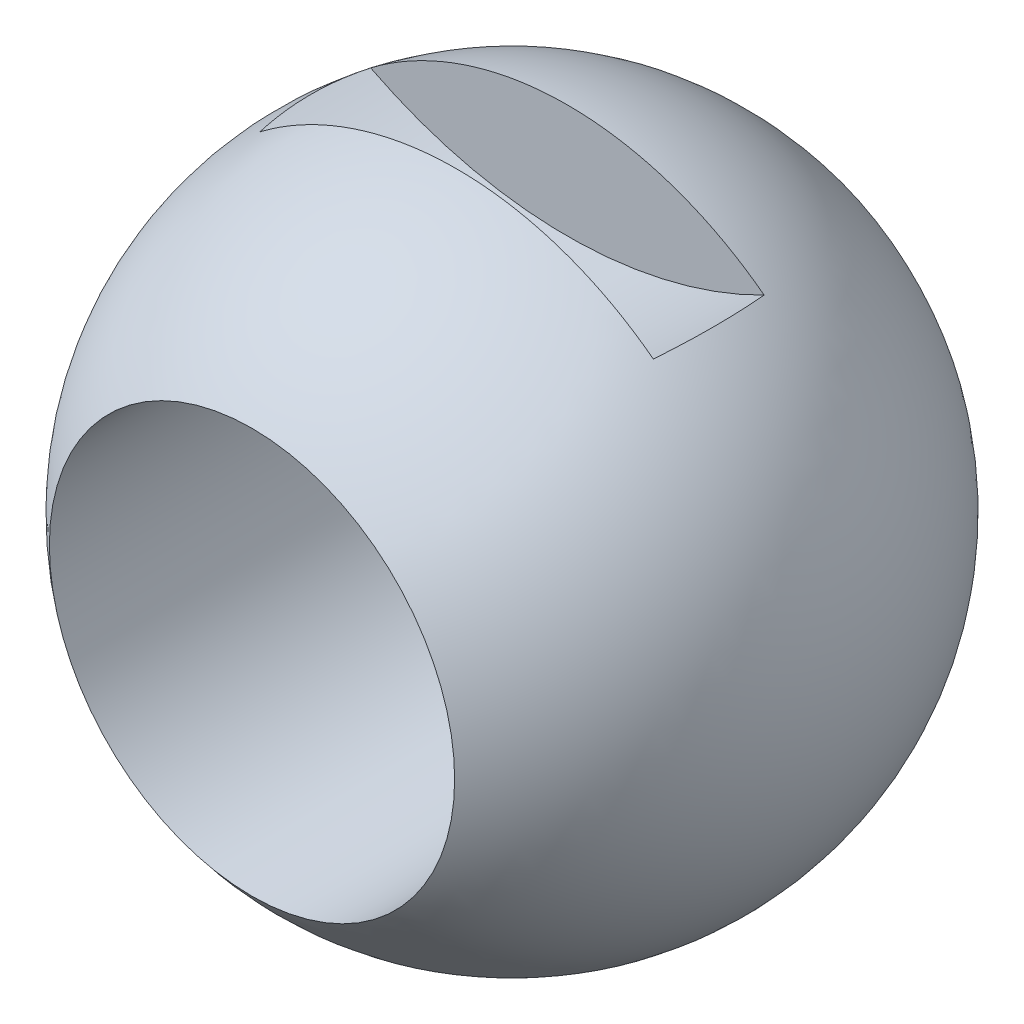
ISO-10303-21;
HEADER;
FILE_DESCRIPTION(('STEP AP214'),'2;1');
FILE_NAME('part.step','',(''),(''),'','','');
FILE_SCHEMA(('AUTOMOTIVE_DESIGN { 1 0 10303 214 1 1 1 1 }'));
ENDSEC;
DATA;
#1=APPLICATION_CONTEXT('core data for automotive mechanical design processes');
#2=APPLICATION_PROTOCOL_DEFINITION('international standard','automotive_design',2000,#1);
#3=PRODUCT_CONTEXT('',#1,'mechanical');
#4=PRODUCT('Part','Part','',(#3));
#5=PRODUCT_RELATED_PRODUCT_CATEGORY('part','',(#4));
#6=PRODUCT_DEFINITION_FORMATION('','',#4);
#7=PRODUCT_DEFINITION_CONTEXT('part definition',#1,'design');
#8=PRODUCT_DEFINITION('design','',#6,#7);
#9=PRODUCT_DEFINITION_SHAPE('','',#8);
#10=(LENGTH_UNIT() NAMED_UNIT(*) SI_UNIT(.MILLI.,.METRE.));
#11=(NAMED_UNIT(*) PLANE_ANGLE_UNIT() SI_UNIT($,.RADIAN.));
#12=(NAMED_UNIT(*) SI_UNIT($,.STERADIAN.) SOLID_ANGLE_UNIT());
#13=UNCERTAINTY_MEASURE_WITH_UNIT(LENGTH_MEASURE(1.E-05),#10,'distance_accuracy_value','');
#14=(GEOMETRIC_REPRESENTATION_CONTEXT(3) GLOBAL_UNCERTAINTY_ASSIGNED_CONTEXT((#13)) GLOBAL_UNIT_ASSIGNED_CONTEXT((#10,
#11,#12)) REPRESENTATION_CONTEXT('',''));
#15=CARTESIAN_POINT('',(0.,0.,0.));
#16=DIRECTION('',(0.,0.,1.));
#17=DIRECTION('',(1.,0.,0.));
#18=AXIS2_PLACEMENT_3D('',#15,#16,#17);
#19=CARTESIAN_POINT('',(0.,0.,0.));
#20=DIRECTION('',(0.,1.,0.));
#21=DIRECTION('',(1.,0.,0.));
#22=AXIS2_PLACEMENT_3D('',#19,#20,#21);
#23=SPHERICAL_SURFACE('',#22,15.494);
#24=CARTESIAN_POINT('',(0.,0.,12.2204096085197));
#25=DIRECTION('',(0.,0.,-1.));
#26=DIRECTION('',(-1.,0.,0.));
#27=AXIS2_PLACEMENT_3D('',#24,#25,#26);
#28=CIRCLE('',#27,9.525);
#29=CARTESIAN_POINT('',(-9.525,0.,12.2204096085197));
#30=VERTEX_POINT('',#29);
#31=EDGE_CURVE('E38',#30,#30,#28,.F.);
#32=ORIENTED_EDGE('',*,*,#31,.F.);
#33=EDGE_LOOP('',(#32));
#34=FACE_BOUND('',#33,.T.);
#35=CARTESIAN_POINT('',(0.,0.,-12.2204096085197));
#36=DIRECTION('',(0.,0.,1.));
#37=DIRECTION('',(1.,0.,0.));
#38=AXIS2_PLACEMENT_3D('',#35,#36,#37);
#39=CIRCLE('',#38,9.525);
#40=CARTESIAN_POINT('',(9.525,0.,-12.2204096085197));
#41=VERTEX_POINT('',#40);
#42=EDGE_CURVE('E76',#41,#41,#39,.F.);
#43=ORIENTED_EDGE('',*,*,#42,.F.);
#44=EDGE_LOOP('',(#43));
#45=FACE_BOUND('',#44,.T.);
#46=CARTESIAN_POINT('',(-9.24731779868117,12.1561464222917,-2.60369999999987));
#47=CARTESIAN_POINT('',(-9.28358755724573,12.1746899394319,-2.38831073949721));
#48=CARTESIAN_POINT('',(-9.31525443009283,12.191003765038,-2.1719875429917));
#49=CARTESIAN_POINT('',(-9.36944165626053,12.2190551355474,-1.73791023557852));
#50=CARTESIAN_POINT('',(-9.39196230272016,12.2307928271166,-1.52015617075789));
#51=CARTESIAN_POINT('',(-9.44557804655422,12.258801415917,-0.86925216968629));
#52=CARTESIAN_POINT('',(-9.46336646019797,12.2682,-0.434626084843145));
#53=CARTESIAN_POINT('',(-9.46336646019797,12.2682,0.434626084843145));
#54=CARTESIAN_POINT('',(-9.44557804655422,12.258801415917,0.86925216968629));
#55=CARTESIAN_POINT('',(-9.39196230272016,12.2307928271166,1.52015617075789));
#56=CARTESIAN_POINT('',(-9.36944165626053,12.2190551355474,1.73791023557852));
#57=CARTESIAN_POINT('',(-9.31525443009283,12.191003765038,2.17198754299171));
#58=CARTESIAN_POINT('',(-9.28358755724573,12.1746899394319,2.38831073949721));
#59=CARTESIAN_POINT('',(-9.24731779868117,12.1561464222917,2.60369999999987));
#60=B_SPLINE_CURVE_WITH_KNOTS('',3,(#46,#47,#48,#49,#50,#51,#52,#53,#54,#55,#56,#57,#58,#59),
.UNSPECIFIED.,.F.,.F.,(4,2,2,2,2,2,4),(0.,0.657497467069434,1.31497385950416,2.61826895870475,
3.92156405790534,4.57904045034006,5.2365379174095),.UNSPECIFIED.);
#61=CARTESIAN_POINT('',(-9.24735148035741,12.1561636361449,-2.6035));
#62=VERTEX_POINT('',#61);
#63=CARTESIAN_POINT('',(-9.24735148035741,12.1561636361449,2.6035));
#64=VERTEX_POINT('',#63);
#65=EDGE_CURVE('E62',#62,#64,#60,.T.);
#66=ORIENTED_EDGE('',*,*,#65,.F.);
#67=CARTESIAN_POINT('',(0.,0.,-2.6035));
#68=DIRECTION('',(0.,0.,1.));
#69=DIRECTION('',(1.,0.,0.));
#70=AXIS2_PLACEMENT_3D('',#67,#68,#69);
#71=CIRCLE('',#70,15.273697121195);
#72=CARTESIAN_POINT('',(9.24735148035741,12.1561636361449,-2.6035));
#73=VERTEX_POINT('',#72);
#74=EDGE_CURVE('E11',#62,#73,#71,.F.);
#75=ORIENTED_EDGE('',*,*,#74,.T.);
#76=CARTESIAN_POINT('',(9.24731779868117,12.1561464222917,2.60369999999987));
#77=CARTESIAN_POINT('',(9.28358755724573,12.1746899394319,2.38831073949721));
#78=CARTESIAN_POINT('',(9.31525443009283,12.191003765038,2.1719875429917));
#79=CARTESIAN_POINT('',(9.36944165626053,12.2190551355474,1.73791023557852));
#80=CARTESIAN_POINT('',(9.39196230272016,12.2307928271166,1.52015617075789));
#81=CARTESIAN_POINT('',(9.44557804655422,12.258801415917,0.86925216968629));
#82=CARTESIAN_POINT('',(9.46336646019797,12.2682,0.434626084843145));
#83=CARTESIAN_POINT('',(9.46336646019797,12.2682,-0.434626084843145));
#84=CARTESIAN_POINT('',(9.44557804655422,12.258801415917,-0.86925216968629));
#85=CARTESIAN_POINT('',(9.39196230272016,12.2307928271166,-1.52015617075789));
#86=CARTESIAN_POINT('',(9.36944165626053,12.2190551355474,-1.73791023557852));
#87=CARTESIAN_POINT('',(9.31525443009283,12.191003765038,-2.17198754299171));
#88=CARTESIAN_POINT('',(9.28358755724573,12.1746899394319,-2.38831073949721));
#89=CARTESIAN_POINT('',(9.24731779868117,12.1561464222917,-2.60369999999987));
#90=B_SPLINE_CURVE_WITH_KNOTS('',3,(#76,#77,#78,#79,#80,#81,#82,#83,#84,#85,#86,#87,#88,#89),
.UNSPECIFIED.,.F.,.F.,(4,2,2,2,2,2,4),(0.,0.657497467069434,1.31497385950416,2.61826895870475,
3.92156405790534,4.57904045034006,5.2365379174095),.UNSPECIFIED.);
#91=CARTESIAN_POINT('',(9.24735148035741,12.1561636361449,2.6035));
#92=VERTEX_POINT('',#91);
#93=EDGE_CURVE('E51',#92,#73,#90,.T.);
#94=ORIENTED_EDGE('',*,*,#93,.F.);
#95=CARTESIAN_POINT('',(0.,0.,2.6035));
#96=DIRECTION('',(0.,0.,1.));
#97=DIRECTION('',(1.,0.,0.));
#98=AXIS2_PLACEMENT_3D('',#95,#96,#97);
#99=CIRCLE('',#98,15.273697121195);
#100=EDGE_CURVE('E43',#64,#92,#99,.F.);
#101=ORIENTED_EDGE('',*,*,#100,.F.);
#102=EDGE_LOOP('',(#66,#75,#94,#101));
#103=FACE_BOUND('',#102,.T.);
#104=ADVANCED_FACE('F34',(#34,#45,#103),#23,.T.);
#105=CARTESIAN_POINT('',(0.,0.,-2.6035));
#106=DIRECTION('',(0.,0.,1.));
#107=DIRECTION('',(1.,0.,0.));
#108=AXIS2_PLACEMENT_3D('',#105,#106,#107);
#109=PLANE('',#108);
#110=ORIENTED_EDGE('',*,*,#74,.F.);
#111=CARTESIAN_POINT('',(0.,30.2500546106902,-2.6035));
#112=DIRECTION('',(0.,0.,1.));
#113=DIRECTION('',(1.,0.,0.));
#114=AXIS2_PLACEMENT_3D('',#111,#112,#113);
#115=CIRCLE('',#114,20.32);
#116=EDGE_CURVE('E67',#62,#73,#115,.T.);
#117=ORIENTED_EDGE('',*,*,#116,.T.);
#118=EDGE_LOOP('',(#110,#117));
#119=FACE_BOUND('',#118,.T.);
#120=ADVANCED_FACE('F92',(#119),#109,.T.);
#121=CARTESIAN_POINT('',(0.,0.,2.6035));
#122=DIRECTION('',(0.,0.,1.));
#123=DIRECTION('',(1.,0.,0.));
#124=AXIS2_PLACEMENT_3D('',#121,#122,#123);
#125=PLANE('',#124);
#126=ORIENTED_EDGE('',*,*,#100,.T.);
#127=CARTESIAN_POINT('',(0.,30.2500546106902,2.6035));
#128=DIRECTION('',(0.,0.,1.));
#129=DIRECTION('',(1.,0.,0.));
#130=AXIS2_PLACEMENT_3D('',#127,#128,#129);
#131=CIRCLE('',#130,20.32);
#132=EDGE_CURVE('E66',#64,#92,#131,.T.);
#133=ORIENTED_EDGE('',*,*,#132,.F.);
#134=EDGE_LOOP('',(#126,#133));
#135=FACE_BOUND('',#134,.T.);
#136=ADVANCED_FACE('F72',(#135),#125,.F.);
#137=CARTESIAN_POINT('',(0.,30.2500546106902,-2.6035));
#138=DIRECTION('',(0.,0.,1.));
#139=DIRECTION('',(1.,0.,0.));
#140=AXIS2_PLACEMENT_3D('',#137,#138,#139);
#141=CYLINDRICAL_SURFACE('',#140,20.32);
#142=ORIENTED_EDGE('',*,*,#93,.T.);
#143=ORIENTED_EDGE('',*,*,#116,.F.);
#144=ORIENTED_EDGE('',*,*,#65,.T.);
#145=ORIENTED_EDGE('',*,*,#132,.T.);
#146=EDGE_LOOP('',(#142,#143,#144,#145));
#147=FACE_BOUND('',#146,.T.);
#148=ADVANCED_FACE('F64',(#147),#141,.F.);
#149=CARTESIAN_POINT('',(0.,0.,-15.494));
#150=DIRECTION('',(0.,0.,1.));
#151=DIRECTION('',(1.,0.,0.));
#152=AXIS2_PLACEMENT_3D('',#149,#150,#151);
#153=CYLINDRICAL_SURFACE('',#152,9.525);
#154=ORIENTED_EDGE('',*,*,#31,.T.);
#155=EDGE_LOOP('',(#154));
#156=FACE_BOUND('',#155,.T.);
#157=ORIENTED_EDGE('',*,*,#42,.T.);
#158=EDGE_LOOP('',(#157));
#159=FACE_BOUND('',#158,.T.);
#160=ADVANCED_FACE('F91',(#156,#159),#153,.F.);
#161=CLOSED_SHELL('',(#104,#120,#136,#148,#160));
#162=MANIFOLD_SOLID_BREP('B2',#161);
#163=ADVANCED_BREP_SHAPE_REPRESENTATION('',(#18,#162),#14);
#164=SHAPE_DEFINITION_REPRESENTATION(#9,#163);
ENDSEC;
END-ISO-10303-21;
